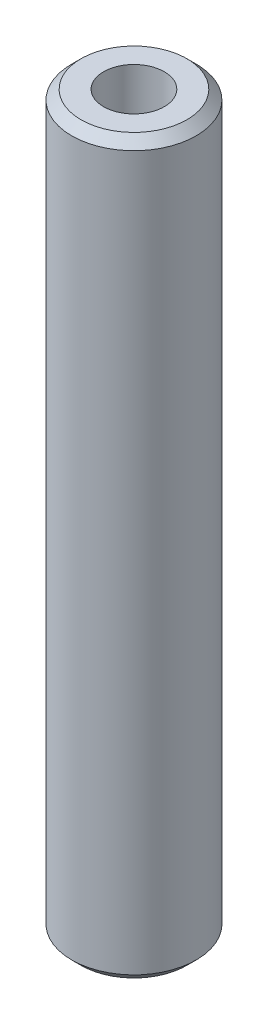
ISO-10303-21;
HEADER;
FILE_DESCRIPTION(('STEP AP214'),'2;1');
FILE_NAME('part.step','',(''),(''),'','','');
FILE_SCHEMA(('AUTOMOTIVE_DESIGN { 1 0 10303 214 1 1 1 1 }'));
ENDSEC;
DATA;
#1=APPLICATION_CONTEXT('core data for automotive mechanical design processes');
#2=APPLICATION_PROTOCOL_DEFINITION('international standard','automotive_design',2000,#1);
#3=PRODUCT_CONTEXT('',#1,'mechanical');
#4=PRODUCT('Part','Part','',(#3));
#5=PRODUCT_RELATED_PRODUCT_CATEGORY('part','',(#4));
#6=PRODUCT_DEFINITION_FORMATION('','',#4);
#7=PRODUCT_DEFINITION_CONTEXT('part definition',#1,'design');
#8=PRODUCT_DEFINITION('design','',#6,#7);
#9=PRODUCT_DEFINITION_SHAPE('','',#8);
#10=(LENGTH_UNIT() NAMED_UNIT(*) SI_UNIT(.MILLI.,.METRE.));
#11=(NAMED_UNIT(*) PLANE_ANGLE_UNIT() SI_UNIT($,.RADIAN.));
#12=(NAMED_UNIT(*) SI_UNIT($,.STERADIAN.) SOLID_ANGLE_UNIT());
#13=UNCERTAINTY_MEASURE_WITH_UNIT(LENGTH_MEASURE(1.E-05),#10,'distance_accuracy_value','');
#14=(GEOMETRIC_REPRESENTATION_CONTEXT(3) GLOBAL_UNCERTAINTY_ASSIGNED_CONTEXT((#13)) GLOBAL_UNIT_ASSIGNED_CONTEXT((#10,
#11,#12)) REPRESENTATION_CONTEXT('',''));
#15=CARTESIAN_POINT('',(0.,0.,0.));
#16=DIRECTION('',(0.,0.,1.));
#17=DIRECTION('',(1.,0.,0.));
#18=AXIS2_PLACEMENT_3D('',#15,#16,#17);
#19=CARTESIAN_POINT('',(0.,294.233916914532,0.));
#20=DIRECTION('',(0.,-1.,0.));
#21=DIRECTION('',(0.,0.,-1.));
#22=AXIS2_PLACEMENT_3D('',#19,#20,#21);
#23=CYLINDRICAL_SURFACE('',#22,25.);
#24=CARTESIAN_POINT('',(0.,290.501936433208,0.));
#25=DIRECTION('',(0.,1.,0.));
#26=DIRECTION('',(0.,0.,1.));
#27=AXIS2_PLACEMENT_3D('',#24,#25,#26);
#28=CIRCLE('',#27,25.);
#29=CARTESIAN_POINT('',(0.,290.501936433208,25.));
#30=VERTEX_POINT('',#29);
#31=EDGE_CURVE('E50',#30,#30,#28,.F.);
#32=ORIENTED_EDGE('',*,*,#31,.T.);
#33=EDGE_LOOP('',(#32));
#34=FACE_BOUND('',#33,.T.);
#35=CARTESIAN_POINT('',(0.,3.73198048132406,0.));
#36=DIRECTION('',(0.,1.,0.));
#37=DIRECTION('',(0.,0.,1.));
#38=AXIS2_PLACEMENT_3D('',#35,#36,#37);
#39=CIRCLE('',#38,25.);
#40=CARTESIAN_POINT('',(0.,3.73198048132406,25.));
#41=VERTEX_POINT('',#40);
#42=EDGE_CURVE('E51',#41,#41,#39,.T.);
#43=ORIENTED_EDGE('',*,*,#42,.T.);
#44=EDGE_LOOP('',(#43));
#45=FACE_BOUND('',#44,.T.);
#46=ADVANCED_FACE('F39',(#34,#45),#23,.T.);
#47=CARTESIAN_POINT('',(0.,294.233916914532,0.));
#48=DIRECTION('',(0.,1.,0.));
#49=DIRECTION('',(0.,0.,1.));
#50=AXIS2_PLACEMENT_3D('',#47,#48,#49);
#51=PLANE('',#50);
#52=CARTESIAN_POINT('',(0.,294.233916914532,0.));
#53=DIRECTION('',(0.,1.,0.));
#54=DIRECTION('',(0.,0.,1.));
#55=AXIS2_PLACEMENT_3D('',#52,#53,#54);
#56=CIRCLE('',#55,21.2680195186759);
#57=CARTESIAN_POINT('',(0.,294.233916914532,21.2680195186759));
#58=VERTEX_POINT('',#57);
#59=EDGE_CURVE('E54',#58,#58,#56,.T.);
#60=ORIENTED_EDGE('',*,*,#59,.T.);
#61=EDGE_LOOP('',(#60));
#62=FACE_BOUND('',#61,.T.);
#63=CARTESIAN_POINT('',(0.,294.233916914532,0.));
#64=DIRECTION('',(0.,1.,0.));
#65=DIRECTION('',(0.,0.,1.));
#66=AXIS2_PLACEMENT_3D('',#63,#64,#65);
#67=CIRCLE('',#66,12.1859999257033);
#68=CARTESIAN_POINT('',(0.,294.233916914532,12.1859999257033));
#69=VERTEX_POINT('',#68);
#70=EDGE_CURVE('E58',#69,#69,#67,.T.);
#71=ORIENTED_EDGE('',*,*,#70,.F.);
#72=EDGE_LOOP('',(#71));
#73=FACE_BOUND('',#72,.T.);
#74=ADVANCED_FACE('F69',(#62,#73),#51,.T.);
#75=CARTESIAN_POINT('',(0.,0.,0.));
#76=DIRECTION('',(0.,1.,0.));
#77=DIRECTION('',(0.,0.,1.));
#78=AXIS2_PLACEMENT_3D('',#75,#76,#77);
#79=PLANE('',#78);
#80=CARTESIAN_POINT('',(0.,0.,0.));
#81=DIRECTION('',(0.,1.,0.));
#82=DIRECTION('',(0.,0.,1.));
#83=AXIS2_PLACEMENT_3D('',#80,#81,#82);
#84=CIRCLE('',#83,21.2680195186759);
#85=CARTESIAN_POINT('',(0.,0.,21.2680195186759));
#86=VERTEX_POINT('',#85);
#87=EDGE_CURVE('E10',#86,#86,#84,.F.);
#88=ORIENTED_EDGE('',*,*,#87,.T.);
#89=EDGE_LOOP('',(#88));
#90=FACE_BOUND('',#89,.T.);
#91=CARTESIAN_POINT('',(0.,0.,0.));
#92=DIRECTION('',(0.,1.,0.));
#93=DIRECTION('',(0.,0.,1.));
#94=AXIS2_PLACEMENT_3D('',#91,#92,#93);
#95=CIRCLE('',#94,12.1859999257033);
#96=CARTESIAN_POINT('',(0.,0.,12.1859999257033));
#97=VERTEX_POINT('',#96);
#98=EDGE_CURVE('E63',#97,#97,#95,.T.);
#99=ORIENTED_EDGE('',*,*,#98,.T.);
#100=EDGE_LOOP('',(#99));
#101=FACE_BOUND('',#100,.T.);
#102=ADVANCED_FACE('F75',(#90,#101),#79,.F.);
#103=CARTESIAN_POINT('',(0.,294.233916914532,0.));
#104=DIRECTION('',(0.,-1.,0.));
#105=DIRECTION('',(0.,0.,-1.));
#106=AXIS2_PLACEMENT_3D('',#103,#104,#105);
#107=CYLINDRICAL_SURFACE('',#106,12.1859999257033);
#108=ORIENTED_EDGE('',*,*,#70,.T.);
#109=EDGE_LOOP('',(#108));
#110=FACE_BOUND('',#109,.T.);
#111=ORIENTED_EDGE('',*,*,#98,.F.);
#112=EDGE_LOOP('',(#111));
#113=FACE_BOUND('',#112,.T.);
#114=ADVANCED_FACE('F70',(#110,#113),#107,.F.);
#115=CARTESIAN_POINT('',(0.,294.233916914532,0.));
#116=DIRECTION('',(0.,-1.,0.));
#117=DIRECTION('',(0.,0.,-1.));
#118=AXIS2_PLACEMENT_3D('',#115,#116,#117);
#119=CONICAL_SURFACE('',#118,21.2680195186759,0.785398163397442);
#120=ORIENTED_EDGE('',*,*,#31,.F.);
#121=EDGE_LOOP('',(#120));
#122=FACE_BOUND('',#121,.T.);
#123=ORIENTED_EDGE('',*,*,#59,.F.);
#124=EDGE_LOOP('',(#123));
#125=FACE_BOUND('',#124,.T.);
#126=ADVANCED_FACE('F81',(#122,#125),#119,.T.);
#127=CARTESIAN_POINT('',(0.,3.73198048132406,0.));
#128=DIRECTION('',(0.,1.,0.));
#129=DIRECTION('',(0.,0.,1.));
#130=AXIS2_PLACEMENT_3D('',#127,#128,#129);
#131=CONICAL_SURFACE('',#130,25.,0.785398163397452);
#132=ORIENTED_EDGE('',*,*,#87,.F.);
#133=EDGE_LOOP('',(#132));
#134=FACE_BOUND('',#133,.T.);
#135=ORIENTED_EDGE('',*,*,#42,.F.);
#136=EDGE_LOOP('',(#135));
#137=FACE_BOUND('',#136,.T.);
#138=ADVANCED_FACE('F45',(#134,#137),#131,.T.);
#139=CLOSED_SHELL('',(#46,#74,#102,#114,#126,#138));
#140=MANIFOLD_SOLID_BREP('B2',#139);
#141=ADVANCED_BREP_SHAPE_REPRESENTATION('',(#18,#140),#14);
#142=SHAPE_DEFINITION_REPRESENTATION(#9,#141);
ENDSEC;
END-ISO-10303-21;
